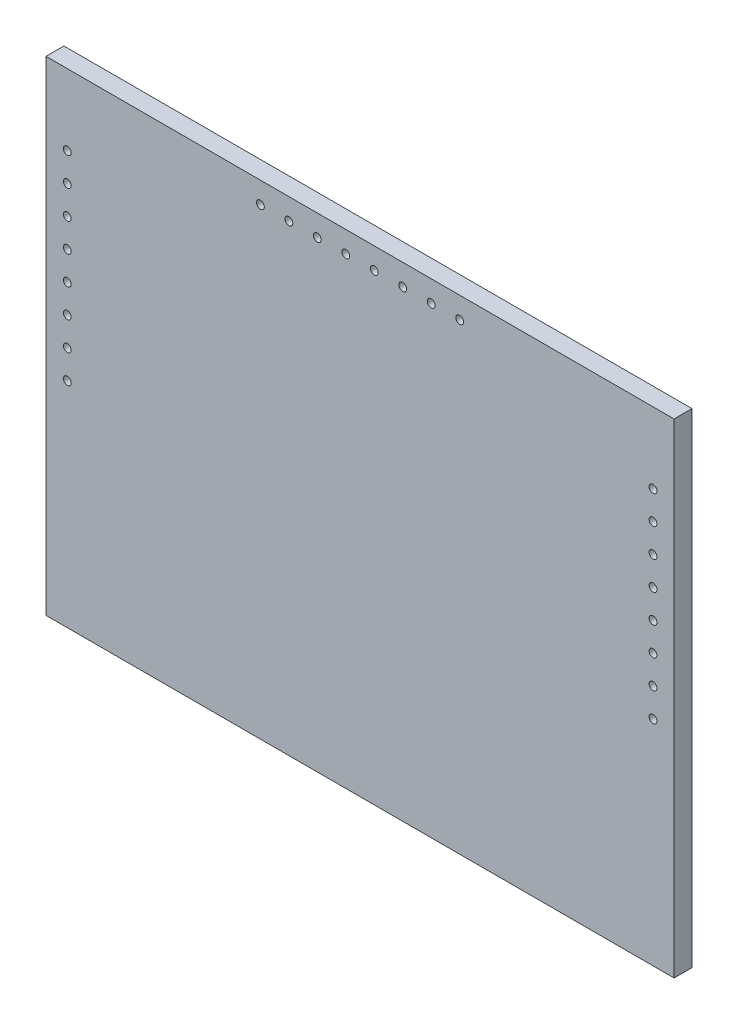
ISO-10303-21;
HEADER;
FILE_DESCRIPTION(('STEP AP214'),'2;1');
FILE_NAME('part.step','',(''),(''),'','','');
FILE_SCHEMA(('AUTOMOTIVE_DESIGN { 1 0 10303 214 1 1 1 1 }'));
ENDSEC;
DATA;
#1=APPLICATION_CONTEXT('core data for automotive mechanical design processes');
#2=APPLICATION_PROTOCOL_DEFINITION('international standard','automotive_design',2000,#1);
#3=PRODUCT_CONTEXT('',#1,'mechanical');
#4=PRODUCT('Part','Part','',(#3));
#5=PRODUCT_RELATED_PRODUCT_CATEGORY('part','',(#4));
#6=PRODUCT_DEFINITION_FORMATION('','',#4);
#7=PRODUCT_DEFINITION_CONTEXT('part definition',#1,'design');
#8=PRODUCT_DEFINITION('design','',#6,#7);
#9=PRODUCT_DEFINITION_SHAPE('','',#8);
#10=(LENGTH_UNIT() NAMED_UNIT(*) SI_UNIT(.MILLI.,.METRE.));
#11=(NAMED_UNIT(*) PLANE_ANGLE_UNIT() SI_UNIT($,.RADIAN.));
#12=(NAMED_UNIT(*) SI_UNIT($,.STERADIAN.) SOLID_ANGLE_UNIT());
#13=UNCERTAINTY_MEASURE_WITH_UNIT(LENGTH_MEASURE(1.E-05),#10,'distance_accuracy_value','');
#14=(GEOMETRIC_REPRESENTATION_CONTEXT(3) GLOBAL_UNCERTAINTY_ASSIGNED_CONTEXT((#13)) GLOBAL_UNIT_ASSIGNED_CONTEXT((#10,
#11,#12)) REPRESENTATION_CONTEXT('',''));
#15=CARTESIAN_POINT('',(0.,0.,0.));
#16=DIRECTION('',(0.,0.,1.));
#17=DIRECTION('',(1.,0.,0.));
#18=AXIS2_PLACEMENT_3D('',#15,#16,#17);
#19=CARTESIAN_POINT('',(130.85,-12.615,10.));
#20=DIRECTION('',(0.,0.,-1.));
#21=DIRECTION('',(-1.,0.,0.));
#22=AXIS2_PLACEMENT_3D('',#19,#20,#21);
#23=CYLINDRICAL_SURFACE('',#22,1.75000000000001);
#24=CARTESIAN_POINT('',(130.85,-12.615,8.));
#25=DIRECTION('',(0.,0.,1.));
#26=DIRECTION('',(1.,0.,0.));
#27=AXIS2_PLACEMENT_3D('',#24,#25,#26);
#28=CIRCLE('',#27,1.75000000000001);
#29=CARTESIAN_POINT('',(132.6,-12.615,8.));
#30=VERTEX_POINT('',#29);
#31=EDGE_CURVE('E45',#30,#30,#28,.T.);
#32=ORIENTED_EDGE('',*,*,#31,.T.);
#33=EDGE_LOOP('',(#32));
#34=FACE_BOUND('',#33,.T.);
#35=CARTESIAN_POINT('',(130.85,-12.615,0.));
#36=DIRECTION('',(0.,0.,-1.));
#37=DIRECTION('',(-1.,0.,0.));
#38=AXIS2_PLACEMENT_3D('',#35,#36,#37);
#39=CIRCLE('',#38,1.75000000000001);
#40=CARTESIAN_POINT('',(129.1,-12.615,0.));
#41=VERTEX_POINT('',#40);
#42=EDGE_CURVE('E11',#41,#41,#39,.T.);
#43=ORIENTED_EDGE('',*,*,#42,.T.);
#44=EDGE_LOOP('',(#43));
#45=FACE_BOUND('',#44,.T.);
#46=ADVANCED_FACE('F37',(#34,#45),#23,.F.);
#47=CARTESIAN_POINT('',(130.85,0.0992857142857184,10.));
#48=DIRECTION('',(0.,0.,-1.));
#49=DIRECTION('',(-1.,0.,0.));
#50=AXIS2_PLACEMENT_3D('',#47,#48,#49);
#51=CYLINDRICAL_SURFACE('',#50,1.75000000000001);
#52=CARTESIAN_POINT('',(130.85,0.0992857142857184,8.));
#53=DIRECTION('',(0.,0.,1.));
#54=DIRECTION('',(1.,0.,0.));
#55=AXIS2_PLACEMENT_3D('',#52,#53,#54);
#56=CIRCLE('',#55,1.75000000000001);
#57=CARTESIAN_POINT('',(132.6,0.0992857142857184,8.));
#58=VERTEX_POINT('',#57);
#59=EDGE_CURVE('E226',#58,#58,#56,.T.);
#60=ORIENTED_EDGE('',*,*,#59,.T.);
#61=EDGE_LOOP('',(#60));
#62=FACE_BOUND('',#61,.T.);
#63=CARTESIAN_POINT('',(130.85,0.0992857142857184,0.));
#64=DIRECTION('',(0.,0.,-1.));
#65=DIRECTION('',(-1.,0.,0.));
#66=AXIS2_PLACEMENT_3D('',#63,#64,#65);
#67=CIRCLE('',#66,1.75000000000001);
#68=CARTESIAN_POINT('',(129.1,0.0992857142857184,0.));
#69=VERTEX_POINT('',#68);
#70=EDGE_CURVE('E229',#69,#69,#67,.T.);
#71=ORIENTED_EDGE('',*,*,#70,.T.);
#72=EDGE_LOOP('',(#71));
#73=FACE_BOUND('',#72,.T.);
#74=ADVANCED_FACE('F253',(#62,#73),#51,.F.);
#75=CARTESIAN_POINT('',(130.85,12.8135714285714,10.));
#76=DIRECTION('',(0.,0.,-1.));
#77=DIRECTION('',(-1.,0.,0.));
#78=AXIS2_PLACEMENT_3D('',#75,#76,#77);
#79=CYLINDRICAL_SURFACE('',#78,1.75000000000001);
#80=CARTESIAN_POINT('',(130.85,12.8135714285714,8.));
#81=DIRECTION('',(0.,0.,1.));
#82=DIRECTION('',(1.,0.,0.));
#83=AXIS2_PLACEMENT_3D('',#80,#81,#82);
#84=CIRCLE('',#83,1.75000000000001);
#85=CARTESIAN_POINT('',(132.6,12.8135714285714,8.));
#86=VERTEX_POINT('',#85);
#87=EDGE_CURVE('E220',#86,#86,#84,.T.);
#88=ORIENTED_EDGE('',*,*,#87,.T.);
#89=EDGE_LOOP('',(#88));
#90=FACE_BOUND('',#89,.T.);
#91=CARTESIAN_POINT('',(130.85,12.8135714285714,0.));
#92=DIRECTION('',(0.,0.,-1.));
#93=DIRECTION('',(-1.,0.,0.));
#94=AXIS2_PLACEMENT_3D('',#91,#92,#93);
#95=CIRCLE('',#94,1.75000000000001);
#96=CARTESIAN_POINT('',(129.1,12.8135714285714,0.));
#97=VERTEX_POINT('',#96);
#98=EDGE_CURVE('E223',#97,#97,#95,.T.);
#99=ORIENTED_EDGE('',*,*,#98,.T.);
#100=EDGE_LOOP('',(#99));
#101=FACE_BOUND('',#100,.T.);
#102=ADVANCED_FACE('F257',(#90,#101),#79,.F.);
#103=CARTESIAN_POINT('',(130.85,25.5278571428571,10.));
#104=DIRECTION('',(0.,0.,-1.));
#105=DIRECTION('',(-1.,0.,0.));
#106=AXIS2_PLACEMENT_3D('',#103,#104,#105);
#107=CYLINDRICAL_SURFACE('',#106,1.75000000000001);
#108=CARTESIAN_POINT('',(130.85,25.5278571428571,8.));
#109=DIRECTION('',(0.,0.,1.));
#110=DIRECTION('',(1.,0.,0.));
#111=AXIS2_PLACEMENT_3D('',#108,#109,#110);
#112=CIRCLE('',#111,1.75000000000001);
#113=CARTESIAN_POINT('',(132.6,25.5278571428571,8.));
#114=VERTEX_POINT('',#113);
#115=EDGE_CURVE('E214',#114,#114,#112,.T.);
#116=ORIENTED_EDGE('',*,*,#115,.T.);
#117=EDGE_LOOP('',(#116));
#118=FACE_BOUND('',#117,.T.);
#119=CARTESIAN_POINT('',(130.85,25.5278571428571,0.));
#120=DIRECTION('',(0.,0.,-1.));
#121=DIRECTION('',(-1.,0.,0.));
#122=AXIS2_PLACEMENT_3D('',#119,#120,#121);
#123=CIRCLE('',#122,1.75000000000001);
#124=CARTESIAN_POINT('',(129.1,25.5278571428571,0.));
#125=VERTEX_POINT('',#124);
#126=EDGE_CURVE('E217',#125,#125,#123,.T.);
#127=ORIENTED_EDGE('',*,*,#126,.T.);
#128=EDGE_LOOP('',(#127));
#129=FACE_BOUND('',#128,.T.);
#130=ADVANCED_FACE('F262',(#118,#129),#107,.F.);
#131=CARTESIAN_POINT('',(130.85,38.2421428571429,10.));
#132=DIRECTION('',(0.,0.,-1.));
#133=DIRECTION('',(-1.,0.,0.));
#134=AXIS2_PLACEMENT_3D('',#131,#132,#133);
#135=CYLINDRICAL_SURFACE('',#134,1.75000000000001);
#136=CARTESIAN_POINT('',(130.85,38.2421428571429,8.));
#137=DIRECTION('',(0.,0.,1.));
#138=DIRECTION('',(1.,0.,0.));
#139=AXIS2_PLACEMENT_3D('',#136,#137,#138);
#140=CIRCLE('',#139,1.75000000000001);
#141=CARTESIAN_POINT('',(132.6,38.2421428571429,8.));
#142=VERTEX_POINT('',#141);
#143=EDGE_CURVE('E208',#142,#142,#140,.T.);
#144=ORIENTED_EDGE('',*,*,#143,.T.);
#145=EDGE_LOOP('',(#144));
#146=FACE_BOUND('',#145,.T.);
#147=CARTESIAN_POINT('',(130.85,38.2421428571429,0.));
#148=DIRECTION('',(0.,0.,-1.));
#149=DIRECTION('',(-1.,0.,0.));
#150=AXIS2_PLACEMENT_3D('',#147,#148,#149);
#151=CIRCLE('',#150,1.75000000000001);
#152=CARTESIAN_POINT('',(129.1,38.2421428571429,0.));
#153=VERTEX_POINT('',#152);
#154=EDGE_CURVE('E211',#153,#153,#151,.T.);
#155=ORIENTED_EDGE('',*,*,#154,.T.);
#156=EDGE_LOOP('',(#155));
#157=FACE_BOUND('',#156,.T.);
#158=ADVANCED_FACE('F269',(#146,#157),#135,.F.);
#159=CARTESIAN_POINT('',(130.85,50.9564285714286,10.));
#160=DIRECTION('',(0.,0.,-1.));
#161=DIRECTION('',(-1.,0.,0.));
#162=AXIS2_PLACEMENT_3D('',#159,#160,#161);
#163=CYLINDRICAL_SURFACE('',#162,1.75000000000001);
#164=CARTESIAN_POINT('',(130.85,50.9564285714286,8.));
#165=DIRECTION('',(0.,0.,1.));
#166=DIRECTION('',(1.,0.,0.));
#167=AXIS2_PLACEMENT_3D('',#164,#165,#166);
#168=CIRCLE('',#167,1.75000000000001);
#169=CARTESIAN_POINT('',(132.6,50.9564285714286,8.));
#170=VERTEX_POINT('',#169);
#171=EDGE_CURVE('E202',#170,#170,#168,.T.);
#172=ORIENTED_EDGE('',*,*,#171,.T.);
#173=EDGE_LOOP('',(#172));
#174=FACE_BOUND('',#173,.T.);
#175=CARTESIAN_POINT('',(130.85,50.9564285714286,0.));
#176=DIRECTION('',(0.,0.,-1.));
#177=DIRECTION('',(-1.,0.,0.));
#178=AXIS2_PLACEMENT_3D('',#175,#176,#177);
#179=CIRCLE('',#178,1.75000000000001);
#180=CARTESIAN_POINT('',(129.1,50.9564285714286,0.));
#181=VERTEX_POINT('',#180);
#182=EDGE_CURVE('E205',#181,#181,#179,.T.);
#183=ORIENTED_EDGE('',*,*,#182,.T.);
#184=EDGE_LOOP('',(#183));
#185=FACE_BOUND('',#184,.T.);
#186=ADVANCED_FACE('F273',(#174,#185),#163,.F.);
#187=CARTESIAN_POINT('',(130.85,63.6707142857143,10.));
#188=DIRECTION('',(0.,0.,-1.));
#189=DIRECTION('',(-1.,0.,0.));
#190=AXIS2_PLACEMENT_3D('',#187,#188,#189);
#191=CYLINDRICAL_SURFACE('',#190,1.75000000000001);
#192=CARTESIAN_POINT('',(130.85,63.6707142857143,8.));
#193=DIRECTION('',(0.,0.,1.));
#194=DIRECTION('',(1.,0.,0.));
#195=AXIS2_PLACEMENT_3D('',#192,#193,#194);
#196=CIRCLE('',#195,1.75000000000001);
#197=CARTESIAN_POINT('',(132.6,63.6707142857143,8.));
#198=VERTEX_POINT('',#197);
#199=EDGE_CURVE('E196',#198,#198,#196,.T.);
#200=ORIENTED_EDGE('',*,*,#199,.T.);
#201=EDGE_LOOP('',(#200));
#202=FACE_BOUND('',#201,.T.);
#203=CARTESIAN_POINT('',(130.85,63.6707142857143,0.));
#204=DIRECTION('',(0.,0.,-1.));
#205=DIRECTION('',(-1.,0.,0.));
#206=AXIS2_PLACEMENT_3D('',#203,#204,#205);
#207=CIRCLE('',#206,1.75000000000001);
#208=CARTESIAN_POINT('',(129.1,63.6707142857143,0.));
#209=VERTEX_POINT('',#208);
#210=EDGE_CURVE('E199',#209,#209,#207,.T.);
#211=ORIENTED_EDGE('',*,*,#210,.T.);
#212=EDGE_LOOP('',(#211));
#213=FACE_BOUND('',#212,.T.);
#214=ADVANCED_FACE('F277',(#202,#213),#191,.F.);
#215=CARTESIAN_POINT('',(130.85,76.385,10.));
#216=DIRECTION('',(0.,0.,-1.));
#217=DIRECTION('',(-1.,0.,0.));
#218=AXIS2_PLACEMENT_3D('',#215,#216,#217);
#219=CYLINDRICAL_SURFACE('',#218,1.75000000000001);
#220=CARTESIAN_POINT('',(130.85,76.385,8.));
#221=DIRECTION('',(0.,0.,1.));
#222=DIRECTION('',(1.,0.,0.));
#223=AXIS2_PLACEMENT_3D('',#220,#221,#222);
#224=CIRCLE('',#223,1.75000000000001);
#225=CARTESIAN_POINT('',(132.6,76.385,8.));
#226=VERTEX_POINT('',#225);
#227=EDGE_CURVE('E190',#226,#226,#224,.T.);
#228=ORIENTED_EDGE('',*,*,#227,.T.);
#229=EDGE_LOOP('',(#228));
#230=FACE_BOUND('',#229,.T.);
#231=CARTESIAN_POINT('',(130.85,76.385,0.));
#232=DIRECTION('',(0.,0.,-1.));
#233=DIRECTION('',(-1.,0.,0.));
#234=AXIS2_PLACEMENT_3D('',#231,#232,#233);
#235=CIRCLE('',#234,1.75000000000001);
#236=CARTESIAN_POINT('',(129.1,76.385,0.));
#237=VERTEX_POINT('',#236);
#238=EDGE_CURVE('E193',#237,#237,#235,.T.);
#239=ORIENTED_EDGE('',*,*,#238,.T.);
#240=EDGE_LOOP('',(#239));
#241=FACE_BOUND('',#240,.T.);
#242=ADVANCED_FACE('F281',(#230,#241),#219,.F.);
#243=CARTESIAN_POINT('',(-130.75,-12.615,10.));
#244=DIRECTION('',(0.,0.,-1.));
#245=DIRECTION('',(-1.,0.,0.));
#246=AXIS2_PLACEMENT_3D('',#243,#244,#245);
#247=CYLINDRICAL_SURFACE('',#246,1.75000000000001);
#248=CARTESIAN_POINT('',(-130.75,-12.615,8.));
#249=DIRECTION('',(0.,0.,1.));
#250=DIRECTION('',(1.,0.,0.));
#251=AXIS2_PLACEMENT_3D('',#248,#249,#250);
#252=CIRCLE('',#251,1.75000000000001);
#253=CARTESIAN_POINT('',(-129.,-12.615,8.));
#254=VERTEX_POINT('',#253);
#255=EDGE_CURVE('E184',#254,#254,#252,.T.);
#256=ORIENTED_EDGE('',*,*,#255,.T.);
#257=EDGE_LOOP('',(#256));
#258=FACE_BOUND('',#257,.T.);
#259=CARTESIAN_POINT('',(-130.75,-12.615,0.));
#260=DIRECTION('',(0.,0.,-1.));
#261=DIRECTION('',(-1.,0.,0.));
#262=AXIS2_PLACEMENT_3D('',#259,#260,#261);
#263=CIRCLE('',#262,1.75000000000001);
#264=CARTESIAN_POINT('',(-132.5,-12.615,0.));
#265=VERTEX_POINT('',#264);
#266=EDGE_CURVE('E187',#265,#265,#263,.T.);
#267=ORIENTED_EDGE('',*,*,#266,.T.);
#268=EDGE_LOOP('',(#267));
#269=FACE_BOUND('',#268,.T.);
#270=ADVANCED_FACE('F285',(#258,#269),#247,.F.);
#271=CARTESIAN_POINT('',(-130.75,0.0992857142857184,10.));
#272=DIRECTION('',(0.,0.,-1.));
#273=DIRECTION('',(-1.,0.,0.));
#274=AXIS2_PLACEMENT_3D('',#271,#272,#273);
#275=CYLINDRICAL_SURFACE('',#274,1.75000000000001);
#276=CARTESIAN_POINT('',(-130.75,0.0992857142857184,8.));
#277=DIRECTION('',(0.,0.,1.));
#278=DIRECTION('',(1.,0.,0.));
#279=AXIS2_PLACEMENT_3D('',#276,#277,#278);
#280=CIRCLE('',#279,1.75000000000001);
#281=CARTESIAN_POINT('',(-129.,0.0992857142857184,8.));
#282=VERTEX_POINT('',#281);
#283=EDGE_CURVE('E178',#282,#282,#280,.T.);
#284=ORIENTED_EDGE('',*,*,#283,.T.);
#285=EDGE_LOOP('',(#284));
#286=FACE_BOUND('',#285,.T.);
#287=CARTESIAN_POINT('',(-130.75,0.0992857142857184,0.));
#288=DIRECTION('',(0.,0.,-1.));
#289=DIRECTION('',(-1.,0.,0.));
#290=AXIS2_PLACEMENT_3D('',#287,#288,#289);
#291=CIRCLE('',#290,1.75000000000001);
#292=CARTESIAN_POINT('',(-132.5,0.0992857142857184,0.));
#293=VERTEX_POINT('',#292);
#294=EDGE_CURVE('E181',#293,#293,#291,.T.);
#295=ORIENTED_EDGE('',*,*,#294,.T.);
#296=EDGE_LOOP('',(#295));
#297=FACE_BOUND('',#296,.T.);
#298=ADVANCED_FACE('F289',(#286,#297),#275,.F.);
#299=CARTESIAN_POINT('',(-130.75,12.8135714285714,10.));
#300=DIRECTION('',(0.,0.,-1.));
#301=DIRECTION('',(-1.,0.,0.));
#302=AXIS2_PLACEMENT_3D('',#299,#300,#301);
#303=CYLINDRICAL_SURFACE('',#302,1.75000000000001);
#304=CARTESIAN_POINT('',(-130.75,12.8135714285714,8.));
#305=DIRECTION('',(0.,0.,1.));
#306=DIRECTION('',(1.,0.,0.));
#307=AXIS2_PLACEMENT_3D('',#304,#305,#306);
#308=CIRCLE('',#307,1.75000000000001);
#309=CARTESIAN_POINT('',(-129.,12.8135714285714,8.));
#310=VERTEX_POINT('',#309);
#311=EDGE_CURVE('E172',#310,#310,#308,.T.);
#312=ORIENTED_EDGE('',*,*,#311,.T.);
#313=EDGE_LOOP('',(#312));
#314=FACE_BOUND('',#313,.T.);
#315=CARTESIAN_POINT('',(-130.75,12.8135714285714,0.));
#316=DIRECTION('',(0.,0.,-1.));
#317=DIRECTION('',(-1.,0.,0.));
#318=AXIS2_PLACEMENT_3D('',#315,#316,#317);
#319=CIRCLE('',#318,1.75000000000001);
#320=CARTESIAN_POINT('',(-132.5,12.8135714285714,0.));
#321=VERTEX_POINT('',#320);
#322=EDGE_CURVE('E175',#321,#321,#319,.T.);
#323=ORIENTED_EDGE('',*,*,#322,.T.);
#324=EDGE_LOOP('',(#323));
#325=FACE_BOUND('',#324,.T.);
#326=ADVANCED_FACE('F293',(#314,#325),#303,.F.);
#327=CARTESIAN_POINT('',(-130.75,25.5278571428571,10.));
#328=DIRECTION('',(0.,0.,-1.));
#329=DIRECTION('',(-1.,0.,0.));
#330=AXIS2_PLACEMENT_3D('',#327,#328,#329);
#331=CYLINDRICAL_SURFACE('',#330,1.75000000000001);
#332=CARTESIAN_POINT('',(-130.75,25.5278571428571,8.));
#333=DIRECTION('',(0.,0.,1.));
#334=DIRECTION('',(1.,0.,0.));
#335=AXIS2_PLACEMENT_3D('',#332,#333,#334);
#336=CIRCLE('',#335,1.75000000000001);
#337=CARTESIAN_POINT('',(-129.,25.5278571428571,8.));
#338=VERTEX_POINT('',#337);
#339=EDGE_CURVE('E166',#338,#338,#336,.T.);
#340=ORIENTED_EDGE('',*,*,#339,.T.);
#341=EDGE_LOOP('',(#340));
#342=FACE_BOUND('',#341,.T.);
#343=CARTESIAN_POINT('',(-130.75,25.5278571428571,0.));
#344=DIRECTION('',(0.,0.,-1.));
#345=DIRECTION('',(-1.,0.,0.));
#346=AXIS2_PLACEMENT_3D('',#343,#344,#345);
#347=CIRCLE('',#346,1.75000000000001);
#348=CARTESIAN_POINT('',(-132.5,25.5278571428571,0.));
#349=VERTEX_POINT('',#348);
#350=EDGE_CURVE('E169',#349,#349,#347,.T.);
#351=ORIENTED_EDGE('',*,*,#350,.T.);
#352=EDGE_LOOP('',(#351));
#353=FACE_BOUND('',#352,.T.);
#354=ADVANCED_FACE('F297',(#342,#353),#331,.F.);
#355=CARTESIAN_POINT('',(-130.75,38.2421428571429,10.));
#356=DIRECTION('',(0.,0.,-1.));
#357=DIRECTION('',(-1.,0.,0.));
#358=AXIS2_PLACEMENT_3D('',#355,#356,#357);
#359=CYLINDRICAL_SURFACE('',#358,1.75000000000001);
#360=CARTESIAN_POINT('',(-130.75,38.2421428571429,8.));
#361=DIRECTION('',(0.,0.,1.));
#362=DIRECTION('',(1.,0.,0.));
#363=AXIS2_PLACEMENT_3D('',#360,#361,#362);
#364=CIRCLE('',#363,1.75000000000001);
#365=CARTESIAN_POINT('',(-129.,38.2421428571429,8.));
#366=VERTEX_POINT('',#365);
#367=EDGE_CURVE('E160',#366,#366,#364,.T.);
#368=ORIENTED_EDGE('',*,*,#367,.T.);
#369=EDGE_LOOP('',(#368));
#370=FACE_BOUND('',#369,.T.);
#371=CARTESIAN_POINT('',(-130.75,38.2421428571429,0.));
#372=DIRECTION('',(0.,0.,-1.));
#373=DIRECTION('',(-1.,0.,0.));
#374=AXIS2_PLACEMENT_3D('',#371,#372,#373);
#375=CIRCLE('',#374,1.75000000000001);
#376=CARTESIAN_POINT('',(-132.5,38.2421428571429,0.));
#377=VERTEX_POINT('',#376);
#378=EDGE_CURVE('E163',#377,#377,#375,.T.);
#379=ORIENTED_EDGE('',*,*,#378,.T.);
#380=EDGE_LOOP('',(#379));
#381=FACE_BOUND('',#380,.T.);
#382=ADVANCED_FACE('F301',(#370,#381),#359,.F.);
#383=CARTESIAN_POINT('',(-130.75,50.9564285714286,10.));
#384=DIRECTION('',(0.,0.,-1.));
#385=DIRECTION('',(-1.,0.,0.));
#386=AXIS2_PLACEMENT_3D('',#383,#384,#385);
#387=CYLINDRICAL_SURFACE('',#386,1.75000000000001);
#388=CARTESIAN_POINT('',(-130.75,50.9564285714286,8.));
#389=DIRECTION('',(0.,0.,1.));
#390=DIRECTION('',(1.,0.,0.));
#391=AXIS2_PLACEMENT_3D('',#388,#389,#390);
#392=CIRCLE('',#391,1.75000000000001);
#393=CARTESIAN_POINT('',(-129.,50.9564285714286,8.));
#394=VERTEX_POINT('',#393);
#395=EDGE_CURVE('E154',#394,#394,#392,.T.);
#396=ORIENTED_EDGE('',*,*,#395,.T.);
#397=EDGE_LOOP('',(#396));
#398=FACE_BOUND('',#397,.T.);
#399=CARTESIAN_POINT('',(-130.75,50.9564285714286,0.));
#400=DIRECTION('',(0.,0.,-1.));
#401=DIRECTION('',(-1.,0.,0.));
#402=AXIS2_PLACEMENT_3D('',#399,#400,#401);
#403=CIRCLE('',#402,1.75000000000001);
#404=CARTESIAN_POINT('',(-132.5,50.9564285714286,0.));
#405=VERTEX_POINT('',#404);
#406=EDGE_CURVE('E157',#405,#405,#403,.T.);
#407=ORIENTED_EDGE('',*,*,#406,.T.);
#408=EDGE_LOOP('',(#407));
#409=FACE_BOUND('',#408,.T.);
#410=ADVANCED_FACE('F305',(#398,#409),#387,.F.);
#411=CARTESIAN_POINT('',(-44.5,98.615,-92.));
#412=DIRECTION('',(0.,0.,1.));
#413=DIRECTION('',(1.,0.,0.));
#414=AXIS2_PLACEMENT_3D('',#411,#412,#413);
#415=CYLINDRICAL_SURFACE('',#414,1.75);
#416=CARTESIAN_POINT('',(-44.5,98.615,8.));
#417=DIRECTION('',(0.,0.,1.));
#418=DIRECTION('',(1.,0.,0.));
#419=AXIS2_PLACEMENT_3D('',#416,#417,#418);
#420=CIRCLE('',#419,1.75);
#421=CARTESIAN_POINT('',(-42.75,98.615,8.));
#422=VERTEX_POINT('',#421);
#423=EDGE_CURVE('E148',#422,#422,#420,.T.);
#424=ORIENTED_EDGE('',*,*,#423,.T.);
#425=EDGE_LOOP('',(#424));
#426=FACE_BOUND('',#425,.T.);
#427=CARTESIAN_POINT('',(-44.5,98.615,0.));
#428=DIRECTION('',(0.,0.,1.));
#429=DIRECTION('',(1.,0.,0.));
#430=AXIS2_PLACEMENT_3D('',#427,#428,#429);
#431=CIRCLE('',#430,1.75);
#432=CARTESIAN_POINT('',(-42.75,98.615,0.));
#433=VERTEX_POINT('',#432);
#434=EDGE_CURVE('E151',#433,#433,#431,.T.);
#435=ORIENTED_EDGE('',*,*,#434,.F.);
#436=EDGE_LOOP('',(#435));
#437=FACE_BOUND('',#436,.T.);
#438=ADVANCED_FACE('F309',(#426,#437),#415,.F.);
#439=CARTESIAN_POINT('',(-31.7857142857143,98.615,-92.));
#440=DIRECTION('',(0.,0.,1.));
#441=DIRECTION('',(1.,0.,0.));
#442=AXIS2_PLACEMENT_3D('',#439,#440,#441);
#443=CYLINDRICAL_SURFACE('',#442,1.75);
#444=CARTESIAN_POINT('',(-31.7857142857143,98.615,8.));
#445=DIRECTION('',(0.,0.,1.));
#446=DIRECTION('',(1.,0.,0.));
#447=AXIS2_PLACEMENT_3D('',#444,#445,#446);
#448=CIRCLE('',#447,1.75);
#449=CARTESIAN_POINT('',(-30.0357142857143,98.615,8.));
#450=VERTEX_POINT('',#449);
#451=EDGE_CURVE('E142',#450,#450,#448,.T.);
#452=ORIENTED_EDGE('',*,*,#451,.T.);
#453=EDGE_LOOP('',(#452));
#454=FACE_BOUND('',#453,.T.);
#455=CARTESIAN_POINT('',(-31.7857142857143,98.615,0.));
#456=DIRECTION('',(0.,0.,1.));
#457=DIRECTION('',(1.,0.,0.));
#458=AXIS2_PLACEMENT_3D('',#455,#456,#457);
#459=CIRCLE('',#458,1.75);
#460=CARTESIAN_POINT('',(-30.0357142857143,98.615,0.));
#461=VERTEX_POINT('',#460);
#462=EDGE_CURVE('E145',#461,#461,#459,.T.);
#463=ORIENTED_EDGE('',*,*,#462,.F.);
#464=EDGE_LOOP('',(#463));
#465=FACE_BOUND('',#464,.T.);
#466=ADVANCED_FACE('F313',(#454,#465),#443,.F.);
#467=CARTESIAN_POINT('',(-19.0714285714286,98.615,-92.));
#468=DIRECTION('',(0.,0.,1.));
#469=DIRECTION('',(1.,0.,0.));
#470=AXIS2_PLACEMENT_3D('',#467,#468,#469);
#471=CYLINDRICAL_SURFACE('',#470,1.75);
#472=CARTESIAN_POINT('',(-19.0714285714286,98.615,8.));
#473=DIRECTION('',(0.,0.,1.));
#474=DIRECTION('',(1.,0.,0.));
#475=AXIS2_PLACEMENT_3D('',#472,#473,#474);
#476=CIRCLE('',#475,1.75);
#477=CARTESIAN_POINT('',(-17.3214285714286,98.615,8.));
#478=VERTEX_POINT('',#477);
#479=EDGE_CURVE('E136',#478,#478,#476,.T.);
#480=ORIENTED_EDGE('',*,*,#479,.T.);
#481=EDGE_LOOP('',(#480));
#482=FACE_BOUND('',#481,.T.);
#483=CARTESIAN_POINT('',(-19.0714285714286,98.615,0.));
#484=DIRECTION('',(0.,0.,1.));
#485=DIRECTION('',(1.,0.,0.));
#486=AXIS2_PLACEMENT_3D('',#483,#484,#485);
#487=CIRCLE('',#486,1.75);
#488=CARTESIAN_POINT('',(-17.3214285714286,98.615,0.));
#489=VERTEX_POINT('',#488);
#490=EDGE_CURVE('E139',#489,#489,#487,.T.);
#491=ORIENTED_EDGE('',*,*,#490,.F.);
#492=EDGE_LOOP('',(#491));
#493=FACE_BOUND('',#492,.T.);
#494=ADVANCED_FACE('F317',(#482,#493),#471,.F.);
#495=CARTESIAN_POINT('',(-6.35714285714287,98.615,-92.));
#496=DIRECTION('',(0.,0.,1.));
#497=DIRECTION('',(1.,0.,0.));
#498=AXIS2_PLACEMENT_3D('',#495,#496,#497);
#499=CYLINDRICAL_SURFACE('',#498,1.75);
#500=CARTESIAN_POINT('',(-6.35714285714287,98.615,8.));
#501=DIRECTION('',(0.,0.,1.));
#502=DIRECTION('',(1.,0.,0.));
#503=AXIS2_PLACEMENT_3D('',#500,#501,#502);
#504=CIRCLE('',#503,1.75);
#505=CARTESIAN_POINT('',(-4.60714285714288,98.615,8.));
#506=VERTEX_POINT('',#505);
#507=EDGE_CURVE('E130',#506,#506,#504,.T.);
#508=ORIENTED_EDGE('',*,*,#507,.T.);
#509=EDGE_LOOP('',(#508));
#510=FACE_BOUND('',#509,.T.);
#511=CARTESIAN_POINT('',(-6.35714285714287,98.615,0.));
#512=DIRECTION('',(0.,0.,1.));
#513=DIRECTION('',(1.,0.,0.));
#514=AXIS2_PLACEMENT_3D('',#511,#512,#513);
#515=CIRCLE('',#514,1.75);
#516=CARTESIAN_POINT('',(-4.60714285714288,98.615,0.));
#517=VERTEX_POINT('',#516);
#518=EDGE_CURVE('E133',#517,#517,#515,.T.);
#519=ORIENTED_EDGE('',*,*,#518,.F.);
#520=EDGE_LOOP('',(#519));
#521=FACE_BOUND('',#520,.T.);
#522=ADVANCED_FACE('F321',(#510,#521),#499,.F.);
#523=CARTESIAN_POINT('',(6.35714285714284,98.615,-92.));
#524=DIRECTION('',(0.,0.,1.));
#525=DIRECTION('',(1.,0.,0.));
#526=AXIS2_PLACEMENT_3D('',#523,#524,#525);
#527=CYLINDRICAL_SURFACE('',#526,1.75);
#528=CARTESIAN_POINT('',(6.35714285714284,98.615,8.));
#529=DIRECTION('',(0.,0.,1.));
#530=DIRECTION('',(1.,0.,0.));
#531=AXIS2_PLACEMENT_3D('',#528,#529,#530);
#532=CIRCLE('',#531,1.75);
#533=CARTESIAN_POINT('',(8.10714285714283,98.615,8.));
#534=VERTEX_POINT('',#533);
#535=EDGE_CURVE('E124',#534,#534,#532,.T.);
#536=ORIENTED_EDGE('',*,*,#535,.T.);
#537=EDGE_LOOP('',(#536));
#538=FACE_BOUND('',#537,.T.);
#539=CARTESIAN_POINT('',(6.35714285714284,98.615,0.));
#540=DIRECTION('',(0.,0.,1.));
#541=DIRECTION('',(1.,0.,0.));
#542=AXIS2_PLACEMENT_3D('',#539,#540,#541);
#543=CIRCLE('',#542,1.75);
#544=CARTESIAN_POINT('',(8.10714285714283,98.615,0.));
#545=VERTEX_POINT('',#544);
#546=EDGE_CURVE('E127',#545,#545,#543,.T.);
#547=ORIENTED_EDGE('',*,*,#546,.F.);
#548=EDGE_LOOP('',(#547));
#549=FACE_BOUND('',#548,.T.);
#550=ADVANCED_FACE('F325',(#538,#549),#527,.F.);
#551=CARTESIAN_POINT('',(19.0714285714286,98.615,-92.));
#552=DIRECTION('',(0.,0.,1.));
#553=DIRECTION('',(1.,0.,0.));
#554=AXIS2_PLACEMENT_3D('',#551,#552,#553);
#555=CYLINDRICAL_SURFACE('',#554,1.75);
#556=CARTESIAN_POINT('',(19.0714285714286,98.615,8.));
#557=DIRECTION('',(0.,0.,1.));
#558=DIRECTION('',(1.,0.,0.));
#559=AXIS2_PLACEMENT_3D('',#556,#557,#558);
#560=CIRCLE('',#559,1.75);
#561=CARTESIAN_POINT('',(20.8214285714286,98.615,8.));
#562=VERTEX_POINT('',#561);
#563=EDGE_CURVE('E115',#562,#562,#560,.T.);
#564=ORIENTED_EDGE('',*,*,#563,.T.);
#565=EDGE_LOOP('',(#564));
#566=FACE_BOUND('',#565,.T.);
#567=CARTESIAN_POINT('',(19.0714285714286,98.615,0.));
#568=DIRECTION('',(0.,0.,1.));
#569=DIRECTION('',(1.,0.,0.));
#570=AXIS2_PLACEMENT_3D('',#567,#568,#569);
#571=CIRCLE('',#570,1.75);
#572=CARTESIAN_POINT('',(20.8214285714286,98.615,0.));
#573=VERTEX_POINT('',#572);
#574=EDGE_CURVE('E121',#573,#573,#571,.T.);
#575=ORIENTED_EDGE('',*,*,#574,.F.);
#576=EDGE_LOOP('',(#575));
#577=FACE_BOUND('',#576,.T.);
#578=ADVANCED_FACE('F329',(#566,#577),#555,.F.);
#579=CARTESIAN_POINT('',(140.25,108.115,8.));
#580=DIRECTION('',(-1.,0.,0.));
#581=DIRECTION('',(0.,-1.,0.));
#582=AXIS2_PLACEMENT_3D('',#579,#580,#581);
#583=PLANE('',#582);
#584=DIRECTION('',(0.,1.,0.));
#585=VECTOR('',#584,1.);
#586=CARTESIAN_POINT('',(140.25,108.115,0.));
#587=LINE('',#586,#585);
#588=CARTESIAN_POINT('',(140.25,-108.115,0.));
#589=VERTEX_POINT('',#588);
#590=CARTESIAN_POINT('',(140.25,108.115,0.));
#591=VERTEX_POINT('',#590);
#592=EDGE_CURVE('E105',#589,#591,#587,.T.);
#593=ORIENTED_EDGE('',*,*,#592,.T.);
#594=DIRECTION('',(0.,0.,-1.));
#595=VECTOR('',#594,1.);
#596=CARTESIAN_POINT('',(140.25,108.115,8.));
#597=LINE('',#596,#595);
#598=CARTESIAN_POINT('',(140.25,108.115,8.));
#599=VERTEX_POINT('',#598);
#600=EDGE_CURVE('E96',#599,#591,#597,.T.);
#601=ORIENTED_EDGE('',*,*,#600,.F.);
#602=DIRECTION('',(0.,1.,0.));
#603=VECTOR('',#602,1.);
#604=CARTESIAN_POINT('',(140.25,108.115,8.));
#605=LINE('',#604,#603);
#606=CARTESIAN_POINT('',(140.25,-108.115,8.));
#607=VERTEX_POINT('',#606);
#608=EDGE_CURVE('E90',#607,#599,#605,.T.);
#609=ORIENTED_EDGE('',*,*,#608,.F.);
#610=DIRECTION('',(0.,0.,-1.));
#611=VECTOR('',#610,1.);
#612=CARTESIAN_POINT('',(140.25,-108.115,8.));
#613=LINE('',#612,#611);
#614=EDGE_CURVE('E101',#607,#589,#613,.T.);
#615=ORIENTED_EDGE('',*,*,#614,.T.);
#616=EDGE_LOOP('',(#593,#601,#609,#615));
#617=FACE_BOUND('',#616,.T.);
#618=ADVANCED_FACE('F333',(#617),#583,.F.);
#619=CARTESIAN_POINT('',(-140.25,108.115,8.));
#620=DIRECTION('',(0.,-1.,0.));
#621=DIRECTION('',(0.,0.,-1.));
#622=AXIS2_PLACEMENT_3D('',#619,#620,#621);
#623=PLANE('',#622);
#624=DIRECTION('',(-1.,0.,0.));
#625=VECTOR('',#624,1.);
#626=CARTESIAN_POINT('',(-140.25,108.115,0.));
#627=LINE('',#626,#625);
#628=CARTESIAN_POINT('',(-140.25,108.115,0.));
#629=VERTEX_POINT('',#628);
#630=EDGE_CURVE('E95',#591,#629,#627,.T.);
#631=ORIENTED_EDGE('',*,*,#630,.T.);
#632=DIRECTION('',(0.,0.,-1.));
#633=VECTOR('',#632,1.);
#634=CARTESIAN_POINT('',(-140.25,108.115,8.));
#635=LINE('',#634,#633);
#636=CARTESIAN_POINT('',(-140.25,108.115,8.));
#637=VERTEX_POINT('',#636);
#638=EDGE_CURVE('E93',#637,#629,#635,.T.);
#639=ORIENTED_EDGE('',*,*,#638,.F.);
#640=DIRECTION('',(-1.,0.,0.));
#641=VECTOR('',#640,1.);
#642=CARTESIAN_POINT('',(-140.25,108.115,8.));
#643=LINE('',#642,#641);
#644=EDGE_CURVE('E84',#599,#637,#643,.T.);
#645=ORIENTED_EDGE('',*,*,#644,.F.);
#646=ORIENTED_EDGE('',*,*,#600,.T.);
#647=EDGE_LOOP('',(#631,#639,#645,#646));
#648=FACE_BOUND('',#647,.T.);
#649=ADVANCED_FACE('F94',(#648),#623,.F.);
#650=CARTESIAN_POINT('',(-140.25,108.115,8.));
#651=DIRECTION('',(1.,0.,0.));
#652=DIRECTION('',(0.,1.,0.));
#653=AXIS2_PLACEMENT_3D('',#650,#651,#652);
#654=PLANE('',#653);
#655=DIRECTION('',(0.,-1.,0.));
#656=VECTOR('',#655,1.);
#657=CARTESIAN_POINT('',(-140.25,108.115,0.));
#658=LINE('',#657,#656);
#659=CARTESIAN_POINT('',(-140.25,-108.115,0.));
#660=VERTEX_POINT('',#659);
#661=EDGE_CURVE('E70',#629,#660,#658,.T.);
#662=ORIENTED_EDGE('',*,*,#661,.T.);
#663=DIRECTION('',(0.,0.,-1.));
#664=VECTOR('',#663,1.);
#665=CARTESIAN_POINT('',(-140.25,-108.115,8.));
#666=LINE('',#665,#664);
#667=CARTESIAN_POINT('',(-140.25,-108.115,8.));
#668=VERTEX_POINT('',#667);
#669=EDGE_CURVE('E97',#668,#660,#666,.T.);
#670=ORIENTED_EDGE('',*,*,#669,.F.);
#671=DIRECTION('',(0.,-1.,0.));
#672=VECTOR('',#671,1.);
#673=CARTESIAN_POINT('',(-140.25,108.115,8.));
#674=LINE('',#673,#672);
#675=EDGE_CURVE('E88',#637,#668,#674,.T.);
#676=ORIENTED_EDGE('',*,*,#675,.F.);
#677=ORIENTED_EDGE('',*,*,#638,.T.);
#678=EDGE_LOOP('',(#662,#670,#676,#677));
#679=FACE_BOUND('',#678,.T.);
#680=ADVANCED_FACE('F99',(#679),#654,.F.);
#681=CARTESIAN_POINT('',(-140.25,-108.115,8.));
#682=DIRECTION('',(0.,1.,0.));
#683=DIRECTION('',(0.,0.,1.));
#684=AXIS2_PLACEMENT_3D('',#681,#682,#683);
#685=PLANE('',#684);
#686=DIRECTION('',(1.,0.,0.));
#687=VECTOR('',#686,1.);
#688=CARTESIAN_POINT('',(-140.25,-108.115,0.));
#689=LINE('',#688,#687);
#690=EDGE_CURVE('E76',#660,#589,#689,.T.);
#691=ORIENTED_EDGE('',*,*,#690,.T.);
#692=ORIENTED_EDGE('',*,*,#614,.F.);
#693=DIRECTION('',(1.,0.,0.));
#694=VECTOR('',#693,1.);
#695=CARTESIAN_POINT('',(-140.25,-108.115,8.));
#696=LINE('',#695,#694);
#697=EDGE_CURVE('E53',#668,#607,#696,.T.);
#698=ORIENTED_EDGE('',*,*,#697,.F.);
#699=ORIENTED_EDGE('',*,*,#669,.T.);
#700=EDGE_LOOP('',(#691,#692,#698,#699));
#701=FACE_BOUND('',#700,.T.);
#702=ADVANCED_FACE('F238',(#701),#685,.F.);
#703=CARTESIAN_POINT('',(0.,0.,8.));
#704=DIRECTION('',(0.,0.,1.));
#705=DIRECTION('',(1.,0.,0.));
#706=AXIS2_PLACEMENT_3D('',#703,#704,#705);
#707=PLANE('',#706);
#708=CARTESIAN_POINT('',(-130.75,63.6707142857143,8.));
#709=DIRECTION('',(0.,0.,1.));
#710=DIRECTION('',(1.,0.,0.));
#711=AXIS2_PLACEMENT_3D('',#708,#709,#710);
#712=CIRCLE('',#711,1.75000000000001);
#713=CARTESIAN_POINT('',(-129.,63.6707142857143,8.));
#714=VERTEX_POINT('',#713);
#715=EDGE_CURVE('E519',#714,#714,#712,.T.);
#716=ORIENTED_EDGE('',*,*,#715,.F.);
#717=EDGE_LOOP('',(#716));
#718=FACE_BOUND('',#717,.T.);
#719=CARTESIAN_POINT('',(-130.75,76.385,8.));
#720=DIRECTION('',(0.,0.,1.));
#721=DIRECTION('',(1.,0.,0.));
#722=AXIS2_PLACEMENT_3D('',#719,#720,#721);
#723=CIRCLE('',#722,1.75000000000001);
#724=CARTESIAN_POINT('',(-129.,76.385,8.));
#725=VERTEX_POINT('',#724);
#726=EDGE_CURVE('E526',#725,#725,#723,.T.);
#727=ORIENTED_EDGE('',*,*,#726,.F.);
#728=EDGE_LOOP('',(#727));
#729=FACE_BOUND('',#728,.T.);
#730=CARTESIAN_POINT('',(31.7857142857143,98.615,8.));
#731=DIRECTION('',(0.,0.,1.));
#732=DIRECTION('',(1.,0.,0.));
#733=AXIS2_PLACEMENT_3D('',#730,#731,#732);
#734=CIRCLE('',#733,1.75);
#735=CARTESIAN_POINT('',(33.5357142857143,98.615,8.));
#736=VERTEX_POINT('',#735);
#737=EDGE_CURVE('E532',#736,#736,#734,.T.);
#738=ORIENTED_EDGE('',*,*,#737,.F.);
#739=EDGE_LOOP('',(#738));
#740=FACE_BOUND('',#739,.T.);
#741=CARTESIAN_POINT('',(44.5,98.615,8.));
#742=DIRECTION('',(0.,0.,1.));
#743=DIRECTION('',(1.,0.,0.));
#744=AXIS2_PLACEMENT_3D('',#741,#742,#743);
#745=CIRCLE('',#744,1.75);
#746=CARTESIAN_POINT('',(46.25,98.615,8.));
#747=VERTEX_POINT('',#746);
#748=EDGE_CURVE('E118',#747,#747,#745,.T.);
#749=ORIENTED_EDGE('',*,*,#748,.F.);
#750=EDGE_LOOP('',(#749));
#751=FACE_BOUND('',#750,.T.);
#752=ORIENTED_EDGE('',*,*,#608,.T.);
#753=ORIENTED_EDGE('',*,*,#644,.T.);
#754=ORIENTED_EDGE('',*,*,#675,.T.);
#755=ORIENTED_EDGE('',*,*,#697,.T.);
#756=EDGE_LOOP('',(#752,#753,#754,#755));
#757=FACE_BOUND('',#756,.T.);
#758=ORIENTED_EDGE('',*,*,#563,.F.);
#759=EDGE_LOOP('',(#758));
#760=FACE_BOUND('',#759,.T.);
#761=ORIENTED_EDGE('',*,*,#535,.F.);
#762=EDGE_LOOP('',(#761));
#763=FACE_BOUND('',#762,.T.);
#764=ORIENTED_EDGE('',*,*,#507,.F.);
#765=EDGE_LOOP('',(#764));
#766=FACE_BOUND('',#765,.T.);
#767=ORIENTED_EDGE('',*,*,#479,.F.);
#768=EDGE_LOOP('',(#767));
#769=FACE_BOUND('',#768,.T.);
#770=ORIENTED_EDGE('',*,*,#451,.F.);
#771=EDGE_LOOP('',(#770));
#772=FACE_BOUND('',#771,.T.);
#773=ORIENTED_EDGE('',*,*,#423,.F.);
#774=EDGE_LOOP('',(#773));
#775=FACE_BOUND('',#774,.T.);
#776=ORIENTED_EDGE('',*,*,#395,.F.);
#777=EDGE_LOOP('',(#776));
#778=FACE_BOUND('',#777,.T.);
#779=ORIENTED_EDGE('',*,*,#367,.F.);
#780=EDGE_LOOP('',(#779));
#781=FACE_BOUND('',#780,.T.);
#782=ORIENTED_EDGE('',*,*,#339,.F.);
#783=EDGE_LOOP('',(#782));
#784=FACE_BOUND('',#783,.T.);
#785=ORIENTED_EDGE('',*,*,#311,.F.);
#786=EDGE_LOOP('',(#785));
#787=FACE_BOUND('',#786,.T.);
#788=ORIENTED_EDGE('',*,*,#283,.F.);
#789=EDGE_LOOP('',(#788));
#790=FACE_BOUND('',#789,.T.);
#791=ORIENTED_EDGE('',*,*,#255,.F.);
#792=EDGE_LOOP('',(#791));
#793=FACE_BOUND('',#792,.T.);
#794=ORIENTED_EDGE('',*,*,#227,.F.);
#795=EDGE_LOOP('',(#794));
#796=FACE_BOUND('',#795,.T.);
#797=ORIENTED_EDGE('',*,*,#199,.F.);
#798=EDGE_LOOP('',(#797));
#799=FACE_BOUND('',#798,.T.);
#800=ORIENTED_EDGE('',*,*,#171,.F.);
#801=EDGE_LOOP('',(#800));
#802=FACE_BOUND('',#801,.T.);
#803=ORIENTED_EDGE('',*,*,#143,.F.);
#804=EDGE_LOOP('',(#803));
#805=FACE_BOUND('',#804,.T.);
#806=ORIENTED_EDGE('',*,*,#115,.F.);
#807=EDGE_LOOP('',(#806));
#808=FACE_BOUND('',#807,.T.);
#809=ORIENTED_EDGE('',*,*,#87,.F.);
#810=EDGE_LOOP('',(#809));
#811=FACE_BOUND('',#810,.T.);
#812=ORIENTED_EDGE('',*,*,#59,.F.);
#813=EDGE_LOOP('',(#812));
#814=FACE_BOUND('',#813,.T.);
#815=ORIENTED_EDGE('',*,*,#31,.F.);
#816=EDGE_LOOP('',(#815));
#817=FACE_BOUND('',#816,.T.);
#818=ADVANCED_FACE('F85',(#718,#729,#740,#751,#757,#760,#763,#766,#769,#772,#775,#778,#781,#784,
#787,#790,#793,#796,#799,#802,#805,#808,#811,#814,#817),#707,.T.);
#819=CARTESIAN_POINT('',(0.,0.,0.));
#820=DIRECTION('',(0.,0.,1.));
#821=DIRECTION('',(1.,0.,0.));
#822=AXIS2_PLACEMENT_3D('',#819,#820,#821);
#823=PLANE('',#822);
#824=CARTESIAN_POINT('',(-130.75,63.6707142857143,0.));
#825=DIRECTION('',(0.,0.,-1.));
#826=DIRECTION('',(-1.,0.,0.));
#827=AXIS2_PLACEMENT_3D('',#824,#825,#826);
#828=CIRCLE('',#827,1.75000000000001);
#829=CARTESIAN_POINT('',(-132.5,63.6707142857143,0.));
#830=VERTEX_POINT('',#829);
#831=EDGE_CURVE('E522',#830,#830,#828,.T.);
#832=ORIENTED_EDGE('',*,*,#831,.F.);
#833=EDGE_LOOP('',(#832));
#834=FACE_BOUND('',#833,.T.);
#835=CARTESIAN_POINT('',(-130.75,76.385,0.));
#836=DIRECTION('',(0.,0.,-1.));
#837=DIRECTION('',(-1.,0.,0.));
#838=AXIS2_PLACEMENT_3D('',#835,#836,#837);
#839=CIRCLE('',#838,1.75000000000001);
#840=CARTESIAN_POINT('',(-132.5,76.385,0.));
#841=VERTEX_POINT('',#840);
#842=EDGE_CURVE('E523',#841,#841,#839,.T.);
#843=ORIENTED_EDGE('',*,*,#842,.F.);
#844=EDGE_LOOP('',(#843));
#845=FACE_BOUND('',#844,.T.);
#846=CARTESIAN_POINT('',(31.7857142857143,98.615,0.));
#847=DIRECTION('',(0.,0.,1.));
#848=DIRECTION('',(1.,0.,0.));
#849=AXIS2_PLACEMENT_3D('',#846,#847,#848);
#850=CIRCLE('',#849,1.75);
#851=CARTESIAN_POINT('',(33.5357142857143,98.615,0.));
#852=VERTEX_POINT('',#851);
#853=EDGE_CURVE('E535',#852,#852,#850,.T.);
#854=ORIENTED_EDGE('',*,*,#853,.T.);
#855=EDGE_LOOP('',(#854));
#856=FACE_BOUND('',#855,.T.);
#857=CARTESIAN_POINT('',(44.5,98.615,0.));
#858=DIRECTION('',(0.,0.,1.));
#859=DIRECTION('',(1.,0.,0.));
#860=AXIS2_PLACEMENT_3D('',#857,#858,#859);
#861=CIRCLE('',#860,1.75);
#862=CARTESIAN_POINT('',(46.25,98.615,0.));
#863=VERTEX_POINT('',#862);
#864=EDGE_CURVE('E108',#863,#863,#861,.T.);
#865=ORIENTED_EDGE('',*,*,#864,.T.);
#866=EDGE_LOOP('',(#865));
#867=FACE_BOUND('',#866,.T.);
#868=ORIENTED_EDGE('',*,*,#592,.F.);
#869=ORIENTED_EDGE('',*,*,#690,.F.);
#870=ORIENTED_EDGE('',*,*,#661,.F.);
#871=ORIENTED_EDGE('',*,*,#630,.F.);
#872=EDGE_LOOP('',(#868,#869,#870,#871));
#873=FACE_BOUND('',#872,.T.);
#874=ORIENTED_EDGE('',*,*,#574,.T.);
#875=EDGE_LOOP('',(#874));
#876=FACE_BOUND('',#875,.T.);
#877=ORIENTED_EDGE('',*,*,#546,.T.);
#878=EDGE_LOOP('',(#877));
#879=FACE_BOUND('',#878,.T.);
#880=ORIENTED_EDGE('',*,*,#518,.T.);
#881=EDGE_LOOP('',(#880));
#882=FACE_BOUND('',#881,.T.);
#883=ORIENTED_EDGE('',*,*,#490,.T.);
#884=EDGE_LOOP('',(#883));
#885=FACE_BOUND('',#884,.T.);
#886=ORIENTED_EDGE('',*,*,#462,.T.);
#887=EDGE_LOOP('',(#886));
#888=FACE_BOUND('',#887,.T.);
#889=ORIENTED_EDGE('',*,*,#434,.T.);
#890=EDGE_LOOP('',(#889));
#891=FACE_BOUND('',#890,.T.);
#892=ORIENTED_EDGE('',*,*,#406,.F.);
#893=EDGE_LOOP('',(#892));
#894=FACE_BOUND('',#893,.T.);
#895=ORIENTED_EDGE('',*,*,#378,.F.);
#896=EDGE_LOOP('',(#895));
#897=FACE_BOUND('',#896,.T.);
#898=ORIENTED_EDGE('',*,*,#350,.F.);
#899=EDGE_LOOP('',(#898));
#900=FACE_BOUND('',#899,.T.);
#901=ORIENTED_EDGE('',*,*,#322,.F.);
#902=EDGE_LOOP('',(#901));
#903=FACE_BOUND('',#902,.T.);
#904=ORIENTED_EDGE('',*,*,#294,.F.);
#905=EDGE_LOOP('',(#904));
#906=FACE_BOUND('',#905,.T.);
#907=ORIENTED_EDGE('',*,*,#266,.F.);
#908=EDGE_LOOP('',(#907));
#909=FACE_BOUND('',#908,.T.);
#910=ORIENTED_EDGE('',*,*,#238,.F.);
#911=EDGE_LOOP('',(#910));
#912=FACE_BOUND('',#911,.T.);
#913=ORIENTED_EDGE('',*,*,#210,.F.);
#914=EDGE_LOOP('',(#913));
#915=FACE_BOUND('',#914,.T.);
#916=ORIENTED_EDGE('',*,*,#182,.F.);
#917=EDGE_LOOP('',(#916));
#918=FACE_BOUND('',#917,.T.);
#919=ORIENTED_EDGE('',*,*,#154,.F.);
#920=EDGE_LOOP('',(#919));
#921=FACE_BOUND('',#920,.T.);
#922=ORIENTED_EDGE('',*,*,#126,.F.);
#923=EDGE_LOOP('',(#922));
#924=FACE_BOUND('',#923,.T.);
#925=ORIENTED_EDGE('',*,*,#98,.F.);
#926=EDGE_LOOP('',(#925));
#927=FACE_BOUND('',#926,.T.);
#928=ORIENTED_EDGE('',*,*,#70,.F.);
#929=EDGE_LOOP('',(#928));
#930=FACE_BOUND('',#929,.T.);
#931=ORIENTED_EDGE('',*,*,#42,.F.);
#932=EDGE_LOOP('',(#931));
#933=FACE_BOUND('',#932,.T.);
#934=ADVANCED_FACE('F237',(#834,#845,#856,#867,#873,#876,#879,#882,#885,#888,#891,#894,#897,
#900,#903,#906,#909,#912,#915,#918,#921,#924,#927,#930,#933),#823,.F.);
#935=CARTESIAN_POINT('',(44.5,98.615,-92.));
#936=DIRECTION('',(0.,0.,1.));
#937=DIRECTION('',(1.,0.,0.));
#938=AXIS2_PLACEMENT_3D('',#935,#936,#937);
#939=CYLINDRICAL_SURFACE('',#938,1.75);
#940=ORIENTED_EDGE('',*,*,#748,.T.);
#941=EDGE_LOOP('',(#940));
#942=FACE_BOUND('',#941,.T.);
#943=ORIENTED_EDGE('',*,*,#864,.F.);
#944=EDGE_LOOP('',(#943));
#945=FACE_BOUND('',#944,.T.);
#946=ADVANCED_FACE('F245',(#942,#945),#939,.F.);
#947=CARTESIAN_POINT('',(31.7857142857143,98.615,-92.));
#948=DIRECTION('',(0.,0.,1.));
#949=DIRECTION('',(1.,0.,0.));
#950=AXIS2_PLACEMENT_3D('',#947,#948,#949);
#951=CYLINDRICAL_SURFACE('',#950,1.75);
#952=ORIENTED_EDGE('',*,*,#737,.T.);
#953=EDGE_LOOP('',(#952));
#954=FACE_BOUND('',#953,.T.);
#955=ORIENTED_EDGE('',*,*,#853,.F.);
#956=EDGE_LOOP('',(#955));
#957=FACE_BOUND('',#956,.T.);
#958=ADVANCED_FACE('F359',(#954,#957),#951,.F.);
#959=CARTESIAN_POINT('',(-130.75,76.385,10.));
#960=DIRECTION('',(0.,0.,-1.));
#961=DIRECTION('',(-1.,0.,0.));
#962=AXIS2_PLACEMENT_3D('',#959,#960,#961);
#963=CYLINDRICAL_SURFACE('',#962,1.75000000000001);
#964=ORIENTED_EDGE('',*,*,#726,.T.);
#965=EDGE_LOOP('',(#964));
#966=FACE_BOUND('',#965,.T.);
#967=ORIENTED_EDGE('',*,*,#842,.T.);
#968=EDGE_LOOP('',(#967));
#969=FACE_BOUND('',#968,.T.);
#970=ADVANCED_FACE('F405',(#966,#969),#963,.F.);
#971=CARTESIAN_POINT('',(-130.75,63.6707142857143,10.));
#972=DIRECTION('',(0.,0.,-1.));
#973=DIRECTION('',(-1.,0.,0.));
#974=AXIS2_PLACEMENT_3D('',#971,#972,#973);
#975=CYLINDRICAL_SURFACE('',#974,1.75000000000001);
#976=ORIENTED_EDGE('',*,*,#715,.T.);
#977=EDGE_LOOP('',(#976));
#978=FACE_BOUND('',#977,.T.);
#979=ORIENTED_EDGE('',*,*,#831,.T.);
#980=EDGE_LOOP('',(#979));
#981=FACE_BOUND('',#980,.T.);
#982=ADVANCED_FACE('F414',(#978,#981),#975,.F.);
#983=CLOSED_SHELL('',(#46,#74,#102,#130,#158,#186,#214,#242,#270,#298,#326,#354,#382,#410,#438,
#466,#494,#522,#550,#578,#618,#649,#680,#702,#818,#934,#946,#958,#970,#982));
#984=MANIFOLD_SOLID_BREP('B2',#983);
#985=ADVANCED_BREP_SHAPE_REPRESENTATION('',(#18,#984),#14);
#986=SHAPE_DEFINITION_REPRESENTATION(#9,#985);
ENDSEC;
END-ISO-10303-21;
